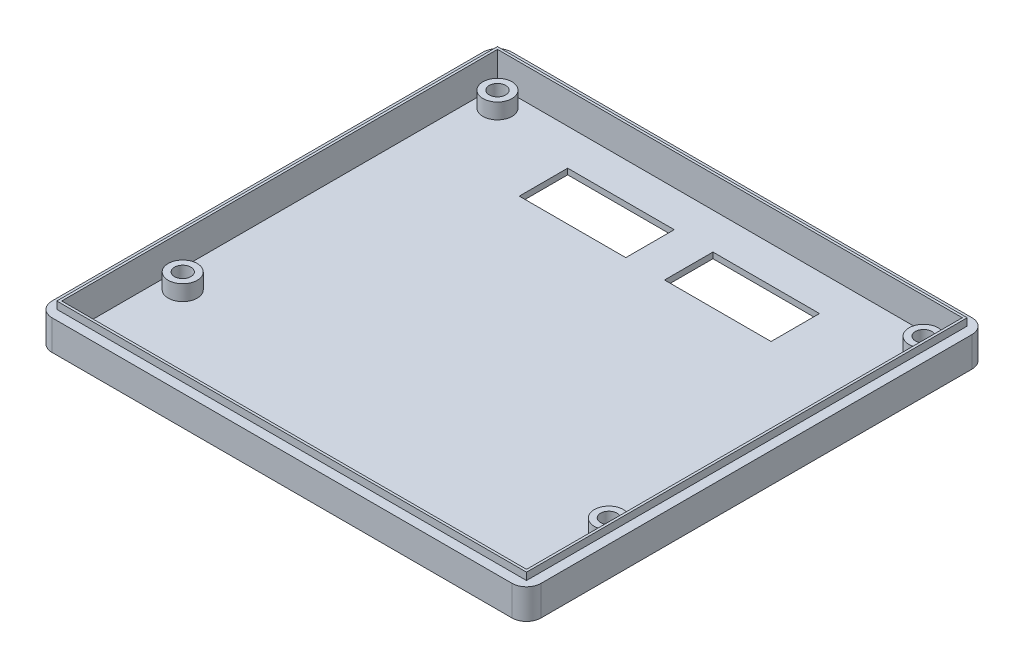
ISO-10303-21;
HEADER;
FILE_DESCRIPTION(('STEP AP214'),'2;1');
FILE_NAME('part.step','',(''),(''),'','','');
FILE_SCHEMA(('AUTOMOTIVE_DESIGN { 1 0 10303 214 1 1 1 1 }'));
ENDSEC;
DATA;
#1=APPLICATION_CONTEXT('core data for automotive mechanical design processes');
#2=APPLICATION_PROTOCOL_DEFINITION('international standard','automotive_design',2000,#1);
#3=PRODUCT_CONTEXT('',#1,'mechanical');
#4=PRODUCT('Part','Part','',(#3));
#5=PRODUCT_RELATED_PRODUCT_CATEGORY('part','',(#4));
#6=PRODUCT_DEFINITION_FORMATION('','',#4);
#7=PRODUCT_DEFINITION_CONTEXT('part definition',#1,'design');
#8=PRODUCT_DEFINITION('design','',#6,#7);
#9=PRODUCT_DEFINITION_SHAPE('','',#8);
#10=(LENGTH_UNIT() NAMED_UNIT(*) SI_UNIT(.MILLI.,.METRE.));
#11=(NAMED_UNIT(*) PLANE_ANGLE_UNIT() SI_UNIT($,.RADIAN.));
#12=(NAMED_UNIT(*) SI_UNIT($,.STERADIAN.) SOLID_ANGLE_UNIT());
#13=UNCERTAINTY_MEASURE_WITH_UNIT(LENGTH_MEASURE(1.E-05),#10,'distance_accuracy_value','');
#14=(GEOMETRIC_REPRESENTATION_CONTEXT(3) GLOBAL_UNCERTAINTY_ASSIGNED_CONTEXT((#13)) GLOBAL_UNIT_ASSIGNED_CONTEXT((#10,
#11,#12)) REPRESENTATION_CONTEXT('',''));
#15=CARTESIAN_POINT('',(0.,0.,0.));
#16=DIRECTION('',(0.,0.,1.));
#17=DIRECTION('',(1.,0.,0.));
#18=AXIS2_PLACEMENT_3D('',#15,#16,#17);
#19=CARTESIAN_POINT('',(0.,6.2,0.));
#20=DIRECTION('',(0.,1.,0.));
#21=DIRECTION('',(0.,0.,1.));
#22=AXIS2_PLACEMENT_3D('',#19,#20,#21);
#23=PLANE('',#22);
#24=DIRECTION('',(1.,0.,0.));
#25=VECTOR('',#24,1.);
#26=CARTESIAN_POINT('',(-4.,6.2,4.));
#27=LINE('',#26,#25);
#28=CARTESIAN_POINT('',(-1.,6.2,4.));
#29=VERTEX_POINT('',#28);
#30=CARTESIAN_POINT('',(94.,6.2,4.));
#31=VERTEX_POINT('',#30);
#32=EDGE_CURVE('E379',#29,#31,#27,.T.);
#33=ORIENTED_EDGE('',*,*,#32,.T.);
#34=CARTESIAN_POINT('',(94.,6.2,1.));
#35=DIRECTION('',(0.,1.,0.));
#36=DIRECTION('',(0.,0.,1.));
#37=AXIS2_PLACEMENT_3D('',#34,#35,#36);
#38=CIRCLE('',#37,3.);
#39=CARTESIAN_POINT('',(97.,6.2,0.999999999999999));
#40=VERTEX_POINT('',#39);
#41=EDGE_CURVE('E422',#31,#40,#38,.T.);
#42=ORIENTED_EDGE('',*,*,#41,.T.);
#43=DIRECTION('',(0.,0.,-1.));
#44=VECTOR('',#43,1.);
#45=CARTESIAN_POINT('',(97.,6.2,4.));
#46=LINE('',#45,#44);
#47=CARTESIAN_POINT('',(97.,6.2,-88.));
#48=VERTEX_POINT('',#47);
#49=EDGE_CURVE('E382',#40,#48,#46,.T.);
#50=ORIENTED_EDGE('',*,*,#49,.T.);
#51=CARTESIAN_POINT('',(94.,6.2,-88.));
#52=DIRECTION('',(0.,1.,0.));
#53=DIRECTION('',(0.,0.,1.));
#54=AXIS2_PLACEMENT_3D('',#51,#52,#53);
#55=CIRCLE('',#54,3.);
#56=CARTESIAN_POINT('',(94.,6.2,-91.));
#57=VERTEX_POINT('',#56);
#58=EDGE_CURVE('E418',#48,#57,#55,.T.);
#59=ORIENTED_EDGE('',*,*,#58,.T.);
#60=DIRECTION('',(-1.,0.,0.));
#61=VECTOR('',#60,1.);
#62=CARTESIAN_POINT('',(97.,6.2,-91.));
#63=LINE('',#62,#61);
#64=CARTESIAN_POINT('',(-1.00000000000003,6.2,-91.));
#65=VERTEX_POINT('',#64);
#66=EDGE_CURVE('E385',#57,#65,#63,.T.);
#67=ORIENTED_EDGE('',*,*,#66,.T.);
#68=CARTESIAN_POINT('',(-1.00000000000003,6.2,-88.));
#69=DIRECTION('',(0.,1.,0.));
#70=DIRECTION('',(0.,0.,1.));
#71=AXIS2_PLACEMENT_3D('',#68,#69,#70);
#72=CIRCLE('',#71,3.);
#73=CARTESIAN_POINT('',(-4.00000000000003,6.2,-88.));
#74=VERTEX_POINT('',#73);
#75=EDGE_CURVE('E416',#65,#74,#72,.T.);
#76=ORIENTED_EDGE('',*,*,#75,.T.);
#77=DIRECTION('',(0.,0.,1.));
#78=VECTOR('',#77,1.);
#79=CARTESIAN_POINT('',(-4.00000000000003,6.2,-91.));
#80=LINE('',#79,#78);
#81=CARTESIAN_POINT('',(-4.,6.2,1.));
#82=VERTEX_POINT('',#81);
#83=EDGE_CURVE('E208',#74,#82,#80,.T.);
#84=ORIENTED_EDGE('',*,*,#83,.T.);
#85=CARTESIAN_POINT('',(-1.,6.2,1.));
#86=DIRECTION('',(0.,1.,0.));
#87=DIRECTION('',(0.,0.,1.));
#88=AXIS2_PLACEMENT_3D('',#85,#86,#87);
#89=CIRCLE('',#88,3.);
#90=EDGE_CURVE('E420',#82,#29,#89,.T.);
#91=ORIENTED_EDGE('',*,*,#90,.T.);
#92=EDGE_LOOP('',(#33,#42,#50,#59,#67,#76,#84,#91));
#93=FACE_BOUND('',#92,.T.);
#94=DIRECTION('',(1.,0.,0.));
#95=VECTOR('',#94,1.);
#96=CARTESIAN_POINT('',(95.,6.2,2.));
#97=LINE('',#96,#95);
#98=CARTESIAN_POINT('',(-2.00000000000003,6.2,2.00000000000001));
#99=VERTEX_POINT('',#98);
#100=CARTESIAN_POINT('',(95.,6.2,2.));
#101=VERTEX_POINT('',#100);
#102=EDGE_CURVE('E242',#99,#101,#97,.T.);
#103=ORIENTED_EDGE('',*,*,#102,.F.);
#104=DIRECTION('',(0.,0.,1.));
#105=VECTOR('',#104,1.);
#106=CARTESIAN_POINT('',(-2.00000000000003,6.2,2.00000000000001));
#107=LINE('',#106,#105);
#108=CARTESIAN_POINT('',(-2.00000000000003,6.2,-89.));
#109=VERTEX_POINT('',#108);
#110=EDGE_CURVE('E228',#109,#99,#107,.T.);
#111=ORIENTED_EDGE('',*,*,#110,.F.);
#112=DIRECTION('',(-1.,0.,0.));
#113=VECTOR('',#112,1.);
#114=CARTESIAN_POINT('',(-2.00000000000003,6.2,-89.));
#115=LINE('',#114,#113);
#116=CARTESIAN_POINT('',(95.,6.2,-89.));
#117=VERTEX_POINT('',#116);
#118=EDGE_CURVE('E233',#117,#109,#115,.T.);
#119=ORIENTED_EDGE('',*,*,#118,.F.);
#120=DIRECTION('',(0.,0.,-1.));
#121=VECTOR('',#120,1.);
#122=CARTESIAN_POINT('',(95.,6.2,-89.));
#123=LINE('',#122,#121);
#124=EDGE_CURVE('E244',#101,#117,#123,.T.);
#125=ORIENTED_EDGE('',*,*,#124,.F.);
#126=EDGE_LOOP('',(#103,#111,#119,#125));
#127=FACE_BOUND('',#126,.T.);
#128=ADVANCED_FACE('F34',(#93,#127),#23,.T.);
#129=CARTESIAN_POINT('',(-4.00000000000003,1.2,-91.));
#130=DIRECTION('',(1.,0.,0.));
#131=DIRECTION('',(0.,0.,-1.));
#132=AXIS2_PLACEMENT_3D('',#129,#130,#131);
#133=PLANE('',#132);
#134=DIRECTION('',(0.,0.,1.));
#135=VECTOR('',#134,1.);
#136=CARTESIAN_POINT('',(-4.00000000000003,0.,-91.));
#137=LINE('',#136,#135);
#138=CARTESIAN_POINT('',(-4.00000000000003,0.,-88.));
#139=VERTEX_POINT('',#138);
#140=CARTESIAN_POINT('',(-4.,0.,1.));
#141=VERTEX_POINT('',#140);
#142=EDGE_CURVE('E387',#139,#141,#137,.T.);
#143=ORIENTED_EDGE('',*,*,#142,.T.);
#144=DIRECTION('',(0.,-1.,0.));
#145=VECTOR('',#144,1.);
#146=CARTESIAN_POINT('',(-4.,1.2,1.));
#147=LINE('',#146,#145);
#148=EDGE_CURVE('E427',#141,#82,#147,.F.);
#149=ORIENTED_EDGE('',*,*,#148,.T.);
#150=ORIENTED_EDGE('',*,*,#83,.F.);
#151=DIRECTION('',(0.,-1.,0.));
#152=VECTOR('',#151,1.);
#153=CARTESIAN_POINT('',(-4.00000000000003,1.2,-88.));
#154=LINE('',#153,#152);
#155=EDGE_CURVE('E424',#74,#139,#154,.T.);
#156=ORIENTED_EDGE('',*,*,#155,.T.);
#157=EDGE_LOOP('',(#143,#149,#150,#156));
#158=FACE_BOUND('',#157,.T.);
#159=ADVANCED_FACE('F431',(#158),#133,.F.);
#160=CARTESIAN_POINT('',(-4.,1.2,4.));
#161=DIRECTION('',(0.,0.,-1.));
#162=DIRECTION('',(-1.,0.,0.));
#163=AXIS2_PLACEMENT_3D('',#160,#161,#162);
#164=PLANE('',#163);
#165=DIRECTION('',(1.,0.,0.));
#166=VECTOR('',#165,1.);
#167=CARTESIAN_POINT('',(-4.,0.,4.));
#168=LINE('',#167,#166);
#169=CARTESIAN_POINT('',(-1.,0.,4.));
#170=VERTEX_POINT('',#169);
#171=CARTESIAN_POINT('',(94.,0.,4.));
#172=VERTEX_POINT('',#171);
#173=EDGE_CURVE('E390',#170,#172,#168,.T.);
#174=ORIENTED_EDGE('',*,*,#173,.T.);
#175=DIRECTION('',(0.,-1.,0.));
#176=VECTOR('',#175,1.);
#177=CARTESIAN_POINT('',(94.,1.2,4.));
#178=LINE('',#177,#176);
#179=EDGE_CURVE('E414',#172,#31,#178,.F.);
#180=ORIENTED_EDGE('',*,*,#179,.T.);
#181=ORIENTED_EDGE('',*,*,#32,.F.);
#182=DIRECTION('',(0.,-1.,0.));
#183=VECTOR('',#182,1.);
#184=CARTESIAN_POINT('',(-1.,1.2,4.));
#185=LINE('',#184,#183);
#186=EDGE_CURVE('E411',#29,#170,#185,.T.);
#187=ORIENTED_EDGE('',*,*,#186,.T.);
#188=EDGE_LOOP('',(#174,#180,#181,#187));
#189=FACE_BOUND('',#188,.T.);
#190=ADVANCED_FACE('F444',(#189),#164,.F.);
#191=CARTESIAN_POINT('',(97.,1.2,4.));
#192=DIRECTION('',(-1.,0.,0.));
#193=DIRECTION('',(0.,0.,1.));
#194=AXIS2_PLACEMENT_3D('',#191,#192,#193);
#195=PLANE('',#194);
#196=ORIENTED_EDGE('',*,*,#49,.F.);
#197=DIRECTION('',(0.,-1.,0.));
#198=VECTOR('',#197,1.);
#199=CARTESIAN_POINT('',(97.,1.2,0.999999999999999));
#200=LINE('',#199,#198);
#201=CARTESIAN_POINT('',(97.,0.,0.999999999999999));
#202=VERTEX_POINT('',#201);
#203=EDGE_CURVE('E400',#40,#202,#200,.T.);
#204=ORIENTED_EDGE('',*,*,#203,.T.);
#205=DIRECTION('',(0.,0.,-1.));
#206=VECTOR('',#205,1.);
#207=CARTESIAN_POINT('',(97.,0.,4.));
#208=LINE('',#207,#206);
#209=CARTESIAN_POINT('',(97.,0.,-88.));
#210=VERTEX_POINT('',#209);
#211=EDGE_CURVE('E393',#202,#210,#208,.T.);
#212=ORIENTED_EDGE('',*,*,#211,.T.);
#213=DIRECTION('',(0.,-1.,0.));
#214=VECTOR('',#213,1.);
#215=CARTESIAN_POINT('',(97.,1.2,-88.));
#216=LINE('',#215,#214);
#217=EDGE_CURVE('E398',#210,#48,#216,.F.);
#218=ORIENTED_EDGE('',*,*,#217,.T.);
#219=EDGE_LOOP('',(#196,#204,#212,#218));
#220=FACE_BOUND('',#219,.T.);
#221=ADVANCED_FACE('F455',(#220),#195,.F.);
#222=CARTESIAN_POINT('',(97.,1.2,-91.));
#223=DIRECTION('',(0.,0.,1.));
#224=DIRECTION('',(1.,0.,0.));
#225=AXIS2_PLACEMENT_3D('',#222,#223,#224);
#226=PLANE('',#225);
#227=ORIENTED_EDGE('',*,*,#66,.F.);
#228=DIRECTION('',(0.,-1.,0.));
#229=VECTOR('',#228,1.);
#230=CARTESIAN_POINT('',(94.,1.2,-91.));
#231=LINE('',#230,#229);
#232=CARTESIAN_POINT('',(94.,0.,-91.));
#233=VERTEX_POINT('',#232);
#234=EDGE_CURVE('E11',#57,#233,#231,.T.);
#235=ORIENTED_EDGE('',*,*,#234,.T.);
#236=DIRECTION('',(-1.,0.,0.));
#237=VECTOR('',#236,1.);
#238=CARTESIAN_POINT('',(97.,0.,-91.));
#239=LINE('',#238,#237);
#240=CARTESIAN_POINT('',(-1.00000000000003,0.,-91.));
#241=VERTEX_POINT('',#240);
#242=EDGE_CURVE('E396',#233,#241,#239,.T.);
#243=ORIENTED_EDGE('',*,*,#242,.T.);
#244=DIRECTION('',(0.,-1.,0.));
#245=VECTOR('',#244,1.);
#246=CARTESIAN_POINT('',(-1.00000000000003,1.2,-91.));
#247=LINE('',#246,#245);
#248=EDGE_CURVE('E42',#241,#65,#247,.F.);
#249=ORIENTED_EDGE('',*,*,#248,.T.);
#250=EDGE_LOOP('',(#227,#235,#243,#249));
#251=FACE_BOUND('',#250,.T.);
#252=ADVANCED_FACE('F462',(#251),#226,.F.);
#253=CARTESIAN_POINT('',(0.,0.,0.));
#254=DIRECTION('',(0.,1.,0.));
#255=DIRECTION('',(0.,0.,1.));
#256=AXIS2_PLACEMENT_3D('',#253,#254,#255);
#257=PLANE('',#256);
#258=DIRECTION('',(1.,0.,0.));
#259=VECTOR('',#258,1.);
#260=CARTESIAN_POINT('',(20.5,0.,-81.));
#261=LINE('',#260,#259);
#262=CARTESIAN_POINT('',(20.5,0.,-81.));
#263=VERTEX_POINT('',#262);
#264=CARTESIAN_POINT('',(42.5,0.,-81.));
#265=VERTEX_POINT('',#264);
#266=EDGE_CURVE('E257',#263,#265,#261,.T.);
#267=ORIENTED_EDGE('',*,*,#266,.F.);
#268=DIRECTION('',(0.,0.,-1.));
#269=VECTOR('',#268,1.);
#270=CARTESIAN_POINT('',(20.5,0.,-71.));
#271=LINE('',#270,#269);
#272=CARTESIAN_POINT('',(20.5,0.,-71.));
#273=VERTEX_POINT('',#272);
#274=EDGE_CURVE('E260',#273,#263,#271,.T.);
#275=ORIENTED_EDGE('',*,*,#274,.F.);
#276=DIRECTION('',(-1.,0.,0.));
#277=VECTOR('',#276,1.);
#278=CARTESIAN_POINT('',(20.5,0.,-71.));
#279=LINE('',#278,#277);
#280=CARTESIAN_POINT('',(42.5,0.,-71.));
#281=VERTEX_POINT('',#280);
#282=EDGE_CURVE('E277',#281,#273,#279,.T.);
#283=ORIENTED_EDGE('',*,*,#282,.F.);
#284=DIRECTION('',(0.,0.,1.));
#285=VECTOR('',#284,1.);
#286=CARTESIAN_POINT('',(42.5,0.,-71.));
#287=LINE('',#286,#285);
#288=EDGE_CURVE('E255',#265,#281,#287,.T.);
#289=ORIENTED_EDGE('',*,*,#288,.F.);
#290=EDGE_LOOP('',(#267,#275,#283,#289));
#291=FACE_BOUND('',#290,.T.);
#292=DIRECTION('',(1.,0.,0.));
#293=VECTOR('',#292,1.);
#294=CARTESIAN_POINT('',(50.5,0.,-81.));
#295=LINE('',#294,#293);
#296=CARTESIAN_POINT('',(50.5,0.,-81.));
#297=VERTEX_POINT('',#296);
#298=CARTESIAN_POINT('',(72.5,0.,-81.));
#299=VERTEX_POINT('',#298);
#300=EDGE_CURVE('E288',#297,#299,#295,.T.);
#301=ORIENTED_EDGE('',*,*,#300,.F.);
#302=DIRECTION('',(0.,0.,-1.));
#303=VECTOR('',#302,1.);
#304=CARTESIAN_POINT('',(50.5,0.,-71.));
#305=LINE('',#304,#303);
#306=CARTESIAN_POINT('',(50.5,0.,-71.));
#307=VERTEX_POINT('',#306);
#308=EDGE_CURVE('E291',#307,#297,#305,.T.);
#309=ORIENTED_EDGE('',*,*,#308,.F.);
#310=DIRECTION('',(-1.,0.,0.));
#311=VECTOR('',#310,1.);
#312=CARTESIAN_POINT('',(50.5,0.,-71.));
#313=LINE('',#312,#311);
#314=CARTESIAN_POINT('',(72.5,0.,-71.));
#315=VERTEX_POINT('',#314);
#316=EDGE_CURVE('E308',#315,#307,#313,.T.);
#317=ORIENTED_EDGE('',*,*,#316,.F.);
#318=DIRECTION('',(0.,0.,1.));
#319=VECTOR('',#318,1.);
#320=CARTESIAN_POINT('',(72.5,0.,-71.));
#321=LINE('',#320,#319);
#322=EDGE_CURVE('E286',#299,#315,#321,.T.);
#323=ORIENTED_EDGE('',*,*,#322,.F.);
#324=EDGE_LOOP('',(#301,#309,#317,#323));
#325=FACE_BOUND('',#324,.T.);
#326=CARTESIAN_POINT('',(2.49999999999997,0.,-19.5));
#327=DIRECTION('',(0.,1.,0.));
#328=DIRECTION('',(0.,0.,1.));
#329=AXIS2_PLACEMENT_3D('',#326,#327,#328);
#330=CIRCLE('',#329,1.7);
#331=CARTESIAN_POINT('',(2.49999999999997,0.,-17.8));
#332=VERTEX_POINT('',#331);
#333=EDGE_CURVE('E320',#332,#332,#330,.F.);
#334=ORIENTED_EDGE('',*,*,#333,.F.);
#335=EDGE_LOOP('',(#334));
#336=FACE_BOUND('',#335,.T.);
#337=CARTESIAN_POINT('',(90.5,0.,-19.5));
#338=DIRECTION('',(0.,1.,0.));
#339=DIRECTION('',(0.,0.,1.));
#340=AXIS2_PLACEMENT_3D('',#337,#338,#339);
#341=CIRCLE('',#340,1.7);
#342=CARTESIAN_POINT('',(90.5,0.,-17.8));
#343=VERTEX_POINT('',#342);
#344=EDGE_CURVE('E326',#343,#343,#341,.F.);
#345=ORIENTED_EDGE('',*,*,#344,.F.);
#346=EDGE_LOOP('',(#345));
#347=FACE_BOUND('',#346,.T.);
#348=CARTESIAN_POINT('',(90.5,0.,-84.5));
#349=DIRECTION('',(0.,1.,0.));
#350=DIRECTION('',(0.,0.,1.));
#351=AXIS2_PLACEMENT_3D('',#348,#349,#350);
#352=CIRCLE('',#351,1.7);
#353=CARTESIAN_POINT('',(90.5,0.,-82.8));
#354=VERTEX_POINT('',#353);
#355=EDGE_CURVE('E332',#354,#354,#352,.F.);
#356=ORIENTED_EDGE('',*,*,#355,.F.);
#357=EDGE_LOOP('',(#356));
#358=FACE_BOUND('',#357,.T.);
#359=CARTESIAN_POINT('',(2.49999999999997,0.,-84.5));
#360=DIRECTION('',(0.,1.,0.));
#361=DIRECTION('',(0.,0.,1.));
#362=AXIS2_PLACEMENT_3D('',#359,#360,#361);
#363=CIRCLE('',#362,1.7);
#364=CARTESIAN_POINT('',(2.49999999999997,0.,-82.8));
#365=VERTEX_POINT('',#364);
#366=EDGE_CURVE('E338',#365,#365,#363,.F.);
#367=ORIENTED_EDGE('',*,*,#366,.F.);
#368=EDGE_LOOP('',(#367));
#369=FACE_BOUND('',#368,.T.);
#370=ORIENTED_EDGE('',*,*,#211,.F.);
#371=CARTESIAN_POINT('',(94.,0.,1.));
#372=DIRECTION('',(0.,1.,0.));
#373=DIRECTION('',(0.,0.,1.));
#374=AXIS2_PLACEMENT_3D('',#371,#372,#373);
#375=CIRCLE('',#374,3.);
#376=EDGE_CURVE('E409',#202,#172,#375,.F.);
#377=ORIENTED_EDGE('',*,*,#376,.T.);
#378=ORIENTED_EDGE('',*,*,#173,.F.);
#379=CARTESIAN_POINT('',(-1.,0.,1.));
#380=DIRECTION('',(0.,1.,0.));
#381=DIRECTION('',(0.,0.,1.));
#382=AXIS2_PLACEMENT_3D('',#379,#380,#381);
#383=CIRCLE('',#382,3.);
#384=EDGE_CURVE('E407',#170,#141,#383,.F.);
#385=ORIENTED_EDGE('',*,*,#384,.T.);
#386=ORIENTED_EDGE('',*,*,#142,.F.);
#387=CARTESIAN_POINT('',(-1.00000000000003,0.,-88.));
#388=DIRECTION('',(0.,1.,0.));
#389=DIRECTION('',(0.,0.,1.));
#390=AXIS2_PLACEMENT_3D('',#387,#388,#389);
#391=CIRCLE('',#390,3.);
#392=EDGE_CURVE('E403',#139,#241,#391,.F.);
#393=ORIENTED_EDGE('',*,*,#392,.T.);
#394=ORIENTED_EDGE('',*,*,#242,.F.);
#395=CARTESIAN_POINT('',(94.,0.,-88.));
#396=DIRECTION('',(0.,1.,0.));
#397=DIRECTION('',(0.,0.,1.));
#398=AXIS2_PLACEMENT_3D('',#395,#396,#397);
#399=CIRCLE('',#398,3.);
#400=EDGE_CURVE('E405',#233,#210,#399,.F.);
#401=ORIENTED_EDGE('',*,*,#400,.T.);
#402=EDGE_LOOP('',(#370,#377,#378,#385,#386,#393,#394,#401));
#403=FACE_BOUND('',#402,.T.);
#404=ADVANCED_FACE('F448',(#291,#325,#336,#347,#358,#369,#403),#257,.F.);
#405=CARTESIAN_POINT('',(-1.50000000000003,6.2,-88.5));
#406=DIRECTION('',(1.,0.,0.));
#407=DIRECTION('',(0.,0.,-1.));
#408=AXIS2_PLACEMENT_3D('',#405,#406,#407);
#409=PLANE('',#408);
#410=DIRECTION('',(0.,0.,1.));
#411=VECTOR('',#410,1.);
#412=CARTESIAN_POINT('',(-1.50000000000003,1.2,-88.5));
#413=LINE('',#412,#411);
#414=CARTESIAN_POINT('',(-1.50000000000003,1.2,-88.5));
#415=VERTEX_POINT('',#414);
#416=CARTESIAN_POINT('',(-1.5,1.2,1.5));
#417=VERTEX_POINT('',#416);
#418=EDGE_CURVE('E363',#415,#417,#413,.T.);
#419=ORIENTED_EDGE('',*,*,#418,.F.);
#420=DIRECTION('',(0.,-1.,0.));
#421=VECTOR('',#420,1.);
#422=CARTESIAN_POINT('',(-1.50000000000003,6.2,-88.5));
#423=LINE('',#422,#421);
#424=CARTESIAN_POINT('',(-1.50000000000003,7.7,-88.5));
#425=VERTEX_POINT('',#424);
#426=EDGE_CURVE('E215',#425,#415,#423,.T.);
#427=ORIENTED_EDGE('',*,*,#426,.F.);
#428=DIRECTION('',(0.,0.,1.));
#429=VECTOR('',#428,1.);
#430=CARTESIAN_POINT('',(-1.5,7.7,1.5));
#431=LINE('',#430,#429);
#432=CARTESIAN_POINT('',(-1.5,7.7,1.5));
#433=VERTEX_POINT('',#432);
#434=EDGE_CURVE('E212',#425,#433,#431,.T.);
#435=ORIENTED_EDGE('',*,*,#434,.T.);
#436=DIRECTION('',(0.,-1.,0.));
#437=VECTOR('',#436,1.);
#438=CARTESIAN_POINT('',(-1.5,6.2,1.5));
#439=LINE('',#438,#437);
#440=EDGE_CURVE('E198',#433,#417,#439,.T.);
#441=ORIENTED_EDGE('',*,*,#440,.T.);
#442=EDGE_LOOP('',(#419,#427,#435,#441));
#443=FACE_BOUND('',#442,.T.);
#444=ADVANCED_FACE('F213',(#443),#409,.T.);
#445=CARTESIAN_POINT('',(-1.5,6.2,1.5));
#446=DIRECTION('',(0.,0.,-1.));
#447=DIRECTION('',(-1.,0.,0.));
#448=AXIS2_PLACEMENT_3D('',#445,#446,#447);
#449=PLANE('',#448);
#450=DIRECTION('',(1.,0.,0.));
#451=VECTOR('',#450,1.);
#452=CARTESIAN_POINT('',(-1.5,1.2,1.5));
#453=LINE('',#452,#451);
#454=CARTESIAN_POINT('',(94.5,1.2,1.5));
#455=VERTEX_POINT('',#454);
#456=EDGE_CURVE('E205',#417,#455,#453,.T.);
#457=ORIENTED_EDGE('',*,*,#456,.F.);
#458=ORIENTED_EDGE('',*,*,#440,.F.);
#459=DIRECTION('',(1.,0.,0.));
#460=VECTOR('',#459,1.);
#461=CARTESIAN_POINT('',(94.5,7.7,1.5));
#462=LINE('',#461,#460);
#463=CARTESIAN_POINT('',(94.5,7.7,1.5));
#464=VERTEX_POINT('',#463);
#465=EDGE_CURVE('E203',#433,#464,#462,.T.);
#466=ORIENTED_EDGE('',*,*,#465,.T.);
#467=DIRECTION('',(0.,-1.,0.));
#468=VECTOR('',#467,1.);
#469=CARTESIAN_POINT('',(94.5,6.2,1.5));
#470=LINE('',#469,#468);
#471=EDGE_CURVE('E209',#464,#455,#470,.T.);
#472=ORIENTED_EDGE('',*,*,#471,.T.);
#473=EDGE_LOOP('',(#457,#458,#466,#472));
#474=FACE_BOUND('',#473,.T.);
#475=ADVANCED_FACE('F200',(#474),#449,.T.);
#476=CARTESIAN_POINT('',(94.5,6.2,1.5));
#477=DIRECTION('',(-1.,0.,0.));
#478=DIRECTION('',(0.,0.,1.));
#479=AXIS2_PLACEMENT_3D('',#476,#477,#478);
#480=PLANE('',#479);
#481=DIRECTION('',(0.,0.,-1.));
#482=VECTOR('',#481,1.);
#483=CARTESIAN_POINT('',(94.5,1.2,1.5));
#484=LINE('',#483,#482);
#485=CARTESIAN_POINT('',(94.5,1.2,-88.5));
#486=VERTEX_POINT('',#485);
#487=EDGE_CURVE('E368',#455,#486,#484,.T.);
#488=ORIENTED_EDGE('',*,*,#487,.F.);
#489=ORIENTED_EDGE('',*,*,#471,.F.);
#490=DIRECTION('',(0.,0.,-1.));
#491=VECTOR('',#490,1.);
#492=CARTESIAN_POINT('',(94.5,7.7,-88.5));
#493=LINE('',#492,#491);
#494=CARTESIAN_POINT('',(94.5,7.7,-88.5));
#495=VERTEX_POINT('',#494);
#496=EDGE_CURVE('E222',#464,#495,#493,.T.);
#497=ORIENTED_EDGE('',*,*,#496,.T.);
#498=DIRECTION('',(0.,-1.,0.));
#499=VECTOR('',#498,1.);
#500=CARTESIAN_POINT('',(94.5,6.2,-88.5));
#501=LINE('',#500,#499);
#502=EDGE_CURVE('E373',#495,#486,#501,.T.);
#503=ORIENTED_EDGE('',*,*,#502,.T.);
#504=EDGE_LOOP('',(#488,#489,#497,#503));
#505=FACE_BOUND('',#504,.T.);
#506=ADVANCED_FACE('F534',(#505),#480,.T.);
#507=CARTESIAN_POINT('',(94.5,6.2,-88.5));
#508=DIRECTION('',(0.,0.,1.));
#509=DIRECTION('',(1.,0.,0.));
#510=AXIS2_PLACEMENT_3D('',#507,#508,#509);
#511=PLANE('',#510);
#512=DIRECTION('',(-1.,0.,0.));
#513=VECTOR('',#512,1.);
#514=CARTESIAN_POINT('',(94.5,1.2,-88.5));
#515=LINE('',#514,#513);
#516=EDGE_CURVE('E370',#486,#415,#515,.T.);
#517=ORIENTED_EDGE('',*,*,#516,.F.);
#518=ORIENTED_EDGE('',*,*,#502,.F.);
#519=DIRECTION('',(-1.,0.,0.));
#520=VECTOR('',#519,1.);
#521=CARTESIAN_POINT('',(-1.50000000000003,7.7,-88.5));
#522=LINE('',#521,#520);
#523=EDGE_CURVE('E224',#495,#425,#522,.T.);
#524=ORIENTED_EDGE('',*,*,#523,.T.);
#525=ORIENTED_EDGE('',*,*,#426,.T.);
#526=EDGE_LOOP('',(#517,#518,#524,#525));
#527=FACE_BOUND('',#526,.T.);
#528=ADVANCED_FACE('F485',(#527),#511,.T.);
#529=CARTESIAN_POINT('',(0.,1.2,0.));
#530=DIRECTION('',(0.,1.,0.));
#531=DIRECTION('',(0.,0.,1.));
#532=AXIS2_PLACEMENT_3D('',#529,#530,#531);
#533=PLANE('',#532);
#534=DIRECTION('',(0.,0.,1.));
#535=VECTOR('',#534,1.);
#536=CARTESIAN_POINT('',(20.5,1.2,-71.));
#537=LINE('',#536,#535);
#538=CARTESIAN_POINT('',(20.5,1.2,-81.));
#539=VERTEX_POINT('',#538);
#540=CARTESIAN_POINT('',(20.5,1.2,-71.));
#541=VERTEX_POINT('',#540);
#542=EDGE_CURVE('E263',#539,#541,#537,.T.);
#543=ORIENTED_EDGE('',*,*,#542,.F.);
#544=DIRECTION('',(-1.,0.,0.));
#545=VECTOR('',#544,1.);
#546=CARTESIAN_POINT('',(20.5,1.2,-81.));
#547=LINE('',#546,#545);
#548=CARTESIAN_POINT('',(42.5,1.2,-81.));
#549=VERTEX_POINT('',#548);
#550=EDGE_CURVE('E271',#549,#539,#547,.T.);
#551=ORIENTED_EDGE('',*,*,#550,.F.);
#552=DIRECTION('',(0.,0.,-1.));
#553=VECTOR('',#552,1.);
#554=CARTESIAN_POINT('',(42.5,1.2,-71.));
#555=LINE('',#554,#553);
#556=CARTESIAN_POINT('',(42.5,1.2,-71.));
#557=VERTEX_POINT('',#556);
#558=EDGE_CURVE('E268',#557,#549,#555,.T.);
#559=ORIENTED_EDGE('',*,*,#558,.F.);
#560=DIRECTION('',(1.,0.,0.));
#561=VECTOR('',#560,1.);
#562=CARTESIAN_POINT('',(20.5,1.2,-71.));
#563=LINE('',#562,#561);
#564=EDGE_CURVE('E265',#541,#557,#563,.T.);
#565=ORIENTED_EDGE('',*,*,#564,.F.);
#566=EDGE_LOOP('',(#543,#551,#559,#565));
#567=FACE_BOUND('',#566,.T.);
#568=DIRECTION('',(0.,0.,1.));
#569=VECTOR('',#568,1.);
#570=CARTESIAN_POINT('',(50.5,1.2,-71.));
#571=LINE('',#570,#569);
#572=CARTESIAN_POINT('',(50.5,1.2,-81.));
#573=VERTEX_POINT('',#572);
#574=CARTESIAN_POINT('',(50.5,1.2,-71.));
#575=VERTEX_POINT('',#574);
#576=EDGE_CURVE('E294',#573,#575,#571,.T.);
#577=ORIENTED_EDGE('',*,*,#576,.F.);
#578=DIRECTION('',(-1.,0.,0.));
#579=VECTOR('',#578,1.);
#580=CARTESIAN_POINT('',(50.5,1.2,-81.));
#581=LINE('',#580,#579);
#582=CARTESIAN_POINT('',(72.5,1.2,-81.));
#583=VERTEX_POINT('',#582);
#584=EDGE_CURVE('E302',#583,#573,#581,.T.);
#585=ORIENTED_EDGE('',*,*,#584,.F.);
#586=DIRECTION('',(0.,0.,-1.));
#587=VECTOR('',#586,1.);
#588=CARTESIAN_POINT('',(72.5,1.2,-71.));
#589=LINE('',#588,#587);
#590=CARTESIAN_POINT('',(72.5,1.2,-71.));
#591=VERTEX_POINT('',#590);
#592=EDGE_CURVE('E299',#591,#583,#589,.T.);
#593=ORIENTED_EDGE('',*,*,#592,.F.);
#594=DIRECTION('',(1.,0.,0.));
#595=VECTOR('',#594,1.);
#596=CARTESIAN_POINT('',(50.5,1.2,-71.));
#597=LINE('',#596,#595);
#598=EDGE_CURVE('E296',#575,#591,#597,.T.);
#599=ORIENTED_EDGE('',*,*,#598,.F.);
#600=EDGE_LOOP('',(#577,#585,#593,#599));
#601=FACE_BOUND('',#600,.T.);
#602=CARTESIAN_POINT('',(2.49999999999997,1.2,-19.5));
#603=DIRECTION('',(0.,1.,0.));
#604=DIRECTION('',(0.,0.,1.));
#605=AXIS2_PLACEMENT_3D('',#602,#603,#604);
#606=CIRCLE('',#605,3.);
#607=CARTESIAN_POINT('',(2.49999999999997,1.2,-16.5));
#608=VERTEX_POINT('',#607);
#609=EDGE_CURVE('E341',#608,#608,#606,.T.);
#610=ORIENTED_EDGE('',*,*,#609,.F.);
#611=EDGE_LOOP('',(#610));
#612=FACE_BOUND('',#611,.T.);
#613=CARTESIAN_POINT('',(90.5,1.2,-19.5));
#614=DIRECTION('',(0.,1.,0.));
#615=DIRECTION('',(0.,0.,1.));
#616=AXIS2_PLACEMENT_3D('',#613,#614,#615);
#617=CIRCLE('',#616,3.00000000000001);
#618=CARTESIAN_POINT('',(90.5,1.2,-16.5));
#619=VERTEX_POINT('',#618);
#620=EDGE_CURVE('E345',#619,#619,#617,.T.);
#621=ORIENTED_EDGE('',*,*,#620,.F.);
#622=EDGE_LOOP('',(#621));
#623=FACE_BOUND('',#622,.T.);
#624=CARTESIAN_POINT('',(90.5,1.2,-84.5));
#625=DIRECTION('',(0.,1.,0.));
#626=DIRECTION('',(0.,0.,1.));
#627=AXIS2_PLACEMENT_3D('',#624,#625,#626);
#628=CIRCLE('',#627,3.00000000000001);
#629=CARTESIAN_POINT('',(90.5,1.2,-81.5));
#630=VERTEX_POINT('',#629);
#631=EDGE_CURVE('E351',#630,#630,#628,.T.);
#632=ORIENTED_EDGE('',*,*,#631,.F.);
#633=EDGE_LOOP('',(#632));
#634=FACE_BOUND('',#633,.T.);
#635=CARTESIAN_POINT('',(2.49999999999997,1.2,-84.5));
#636=DIRECTION('',(0.,1.,0.));
#637=DIRECTION('',(0.,0.,1.));
#638=AXIS2_PLACEMENT_3D('',#635,#636,#637);
#639=CIRCLE('',#638,3.);
#640=CARTESIAN_POINT('',(2.49999999999997,1.2,-81.5));
#641=VERTEX_POINT('',#640);
#642=EDGE_CURVE('E357',#641,#641,#639,.T.);
#643=ORIENTED_EDGE('',*,*,#642,.F.);
#644=EDGE_LOOP('',(#643));
#645=FACE_BOUND('',#644,.T.);
#646=ORIENTED_EDGE('',*,*,#418,.T.);
#647=ORIENTED_EDGE('',*,*,#456,.T.);
#648=ORIENTED_EDGE('',*,*,#487,.T.);
#649=ORIENTED_EDGE('',*,*,#516,.T.);
#650=EDGE_LOOP('',(#646,#647,#648,#649));
#651=FACE_BOUND('',#650,.T.);
#652=ADVANCED_FACE('F481',(#567,#601,#612,#623,#634,#645,#651),#533,.T.);
#653=CARTESIAN_POINT('',(2.49999999999997,4.4,-84.5));
#654=DIRECTION('',(0.,-1.,0.));
#655=DIRECTION('',(0.,0.,-1.));
#656=AXIS2_PLACEMENT_3D('',#653,#654,#655);
#657=CYLINDRICAL_SURFACE('',#656,3.);
#658=CARTESIAN_POINT('',(2.49999999999997,4.4,-84.5));
#659=DIRECTION('',(0.,1.,0.));
#660=DIRECTION('',(0.,0.,1.));
#661=AXIS2_PLACEMENT_3D('',#658,#659,#660);
#662=CIRCLE('',#661,3.);
#663=CARTESIAN_POINT('',(2.49999999999997,4.4,-81.5));
#664=VERTEX_POINT('',#663);
#665=EDGE_CURVE('E360',#664,#664,#662,.T.);
#666=ORIENTED_EDGE('',*,*,#665,.F.);
#667=EDGE_LOOP('',(#666));
#668=FACE_BOUND('',#667,.T.);
#669=ORIENTED_EDGE('',*,*,#642,.T.);
#670=EDGE_LOOP('',(#669));
#671=FACE_BOUND('',#670,.T.);
#672=ADVANCED_FACE('F484',(#668,#671),#657,.T.);
#673=CARTESIAN_POINT('',(2.49999999999997,4.4,-84.5));
#674=DIRECTION('',(0.,1.,0.));
#675=DIRECTION('',(0.,0.,1.));
#676=AXIS2_PLACEMENT_3D('',#673,#674,#675);
#677=PLANE('',#676);
#678=CARTESIAN_POINT('',(2.49999999999997,4.4,-84.5));
#679=DIRECTION('',(0.,1.,0.));
#680=DIRECTION('',(0.,0.,1.));
#681=AXIS2_PLACEMENT_3D('',#678,#679,#680);
#682=CIRCLE('',#681,1.7);
#683=CARTESIAN_POINT('',(2.49999999999997,4.4,-82.8));
#684=VERTEX_POINT('',#683);
#685=EDGE_CURVE('E335',#684,#684,#682,.T.);
#686=ORIENTED_EDGE('',*,*,#685,.F.);
#687=EDGE_LOOP('',(#686));
#688=FACE_BOUND('',#687,.T.);
#689=ORIENTED_EDGE('',*,*,#665,.T.);
#690=EDGE_LOOP('',(#689));
#691=FACE_BOUND('',#690,.T.);
#692=ADVANCED_FACE('F672',(#688,#691),#677,.T.);
#693=CARTESIAN_POINT('',(90.5,4.4,-84.5));
#694=DIRECTION('',(0.,-1.,0.));
#695=DIRECTION('',(0.,0.,-1.));
#696=AXIS2_PLACEMENT_3D('',#693,#694,#695);
#697=CYLINDRICAL_SURFACE('',#696,3.00000000000001);
#698=CARTESIAN_POINT('',(90.5,4.4,-84.5));
#699=DIRECTION('',(0.,1.,0.));
#700=DIRECTION('',(0.,0.,1.));
#701=AXIS2_PLACEMENT_3D('',#698,#699,#700);
#702=CIRCLE('',#701,3.00000000000001);
#703=CARTESIAN_POINT('',(90.5,4.4,-81.5));
#704=VERTEX_POINT('',#703);
#705=EDGE_CURVE('E354',#704,#704,#702,.T.);
#706=ORIENTED_EDGE('',*,*,#705,.F.);
#707=EDGE_LOOP('',(#706));
#708=FACE_BOUND('',#707,.T.);
#709=ORIENTED_EDGE('',*,*,#631,.T.);
#710=EDGE_LOOP('',(#709));
#711=FACE_BOUND('',#710,.T.);
#712=ADVANCED_FACE('F668',(#708,#711),#697,.T.);
#713=CARTESIAN_POINT('',(90.5,4.4,-84.5));
#714=DIRECTION('',(0.,1.,0.));
#715=DIRECTION('',(0.,0.,1.));
#716=AXIS2_PLACEMENT_3D('',#713,#714,#715);
#717=PLANE('',#716);
#718=CARTESIAN_POINT('',(90.5,4.4,-84.5));
#719=DIRECTION('',(0.,1.,0.));
#720=DIRECTION('',(0.,0.,1.));
#721=AXIS2_PLACEMENT_3D('',#718,#719,#720);
#722=CIRCLE('',#721,1.7);
#723=CARTESIAN_POINT('',(90.5,4.4,-82.8));
#724=VERTEX_POINT('',#723);
#725=EDGE_CURVE('E329',#724,#724,#722,.T.);
#726=ORIENTED_EDGE('',*,*,#725,.F.);
#727=EDGE_LOOP('',(#726));
#728=FACE_BOUND('',#727,.T.);
#729=ORIENTED_EDGE('',*,*,#705,.T.);
#730=EDGE_LOOP('',(#729));
#731=FACE_BOUND('',#730,.T.);
#732=ADVANCED_FACE('F664',(#728,#731),#717,.T.);
#733=CARTESIAN_POINT('',(90.5,4.4,-19.5));
#734=DIRECTION('',(0.,-1.,0.));
#735=DIRECTION('',(0.,0.,-1.));
#736=AXIS2_PLACEMENT_3D('',#733,#734,#735);
#737=CYLINDRICAL_SURFACE('',#736,3.00000000000001);
#738=CARTESIAN_POINT('',(90.5,4.4,-19.5));
#739=DIRECTION('',(0.,1.,0.));
#740=DIRECTION('',(0.,0.,1.));
#741=AXIS2_PLACEMENT_3D('',#738,#739,#740);
#742=CIRCLE('',#741,3.00000000000001);
#743=CARTESIAN_POINT('',(90.5,4.4,-16.5));
#744=VERTEX_POINT('',#743);
#745=EDGE_CURVE('E348',#744,#744,#742,.T.);
#746=ORIENTED_EDGE('',*,*,#745,.F.);
#747=EDGE_LOOP('',(#746));
#748=FACE_BOUND('',#747,.T.);
#749=ORIENTED_EDGE('',*,*,#620,.T.);
#750=EDGE_LOOP('',(#749));
#751=FACE_BOUND('',#750,.T.);
#752=ADVANCED_FACE('F660',(#748,#751),#737,.T.);
#753=CARTESIAN_POINT('',(90.5,4.4,-19.5));
#754=DIRECTION('',(0.,1.,0.));
#755=DIRECTION('',(0.,0.,1.));
#756=AXIS2_PLACEMENT_3D('',#753,#754,#755);
#757=PLANE('',#756);
#758=CARTESIAN_POINT('',(90.5,4.4,-19.5));
#759=DIRECTION('',(0.,1.,0.));
#760=DIRECTION('',(0.,0.,1.));
#761=AXIS2_PLACEMENT_3D('',#758,#759,#760);
#762=CIRCLE('',#761,1.7);
#763=CARTESIAN_POINT('',(90.5,4.4,-17.8));
#764=VERTEX_POINT('',#763);
#765=EDGE_CURVE('E323',#764,#764,#762,.T.);
#766=ORIENTED_EDGE('',*,*,#765,.F.);
#767=EDGE_LOOP('',(#766));
#768=FACE_BOUND('',#767,.T.);
#769=ORIENTED_EDGE('',*,*,#745,.T.);
#770=EDGE_LOOP('',(#769));
#771=FACE_BOUND('',#770,.T.);
#772=ADVANCED_FACE('F656',(#768,#771),#757,.T.);
#773=CARTESIAN_POINT('',(2.49999999999997,4.4,-19.5));
#774=DIRECTION('',(0.,-1.,0.));
#775=DIRECTION('',(0.,0.,-1.));
#776=AXIS2_PLACEMENT_3D('',#773,#774,#775);
#777=CYLINDRICAL_SURFACE('',#776,3.);
#778=CARTESIAN_POINT('',(2.49999999999997,4.4,-19.5));
#779=DIRECTION('',(0.,1.,0.));
#780=DIRECTION('',(0.,0.,1.));
#781=AXIS2_PLACEMENT_3D('',#778,#779,#780);
#782=CIRCLE('',#781,3.);
#783=CARTESIAN_POINT('',(2.49999999999997,4.4,-16.5));
#784=VERTEX_POINT('',#783);
#785=EDGE_CURVE('E342',#784,#784,#782,.T.);
#786=ORIENTED_EDGE('',*,*,#785,.F.);
#787=EDGE_LOOP('',(#786));
#788=FACE_BOUND('',#787,.T.);
#789=ORIENTED_EDGE('',*,*,#609,.T.);
#790=EDGE_LOOP('',(#789));
#791=FACE_BOUND('',#790,.T.);
#792=ADVANCED_FACE('F652',(#788,#791),#777,.T.);
#793=CARTESIAN_POINT('',(2.49999999999997,4.4,-19.5));
#794=DIRECTION('',(0.,1.,0.));
#795=DIRECTION('',(0.,0.,1.));
#796=AXIS2_PLACEMENT_3D('',#793,#794,#795);
#797=PLANE('',#796);
#798=CARTESIAN_POINT('',(2.49999999999997,4.4,-19.5));
#799=DIRECTION('',(0.,1.,0.));
#800=DIRECTION('',(0.,0.,1.));
#801=AXIS2_PLACEMENT_3D('',#798,#799,#800);
#802=CIRCLE('',#801,1.7);
#803=CARTESIAN_POINT('',(2.49999999999997,4.4,-17.8));
#804=VERTEX_POINT('',#803);
#805=EDGE_CURVE('E317',#804,#804,#802,.T.);
#806=ORIENTED_EDGE('',*,*,#805,.F.);
#807=EDGE_LOOP('',(#806));
#808=FACE_BOUND('',#807,.T.);
#809=ORIENTED_EDGE('',*,*,#785,.T.);
#810=EDGE_LOOP('',(#809));
#811=FACE_BOUND('',#810,.T.);
#812=ADVANCED_FACE('F648',(#808,#811),#797,.T.);
#813=CARTESIAN_POINT('',(2.49999999999997,-0.00100000000000013,-84.5));
#814=DIRECTION('',(0.,1.,0.));
#815=DIRECTION('',(0.,0.,1.));
#816=AXIS2_PLACEMENT_3D('',#813,#814,#815);
#817=CYLINDRICAL_SURFACE('',#816,1.7);
#818=ORIENTED_EDGE('',*,*,#685,.T.);
#819=EDGE_LOOP('',(#818));
#820=FACE_BOUND('',#819,.T.);
#821=ORIENTED_EDGE('',*,*,#366,.T.);
#822=EDGE_LOOP('',(#821));
#823=FACE_BOUND('',#822,.T.);
#824=ADVANCED_FACE('F644',(#820,#823),#817,.F.);
#825=CARTESIAN_POINT('',(90.5,-0.00100000000000013,-84.5));
#826=DIRECTION('',(0.,1.,0.));
#827=DIRECTION('',(0.,0.,1.));
#828=AXIS2_PLACEMENT_3D('',#825,#826,#827);
#829=CYLINDRICAL_SURFACE('',#828,1.7);
#830=ORIENTED_EDGE('',*,*,#725,.T.);
#831=EDGE_LOOP('',(#830));
#832=FACE_BOUND('',#831,.T.);
#833=ORIENTED_EDGE('',*,*,#355,.T.);
#834=EDGE_LOOP('',(#833));
#835=FACE_BOUND('',#834,.T.);
#836=ADVANCED_FACE('F640',(#832,#835),#829,.F.);
#837=CARTESIAN_POINT('',(90.5,-0.00100000000000013,-19.5));
#838=DIRECTION('',(0.,1.,0.));
#839=DIRECTION('',(0.,0.,1.));
#840=AXIS2_PLACEMENT_3D('',#837,#838,#839);
#841=CYLINDRICAL_SURFACE('',#840,1.7);
#842=ORIENTED_EDGE('',*,*,#765,.T.);
#843=EDGE_LOOP('',(#842));
#844=FACE_BOUND('',#843,.T.);
#845=ORIENTED_EDGE('',*,*,#344,.T.);
#846=EDGE_LOOP('',(#845));
#847=FACE_BOUND('',#846,.T.);
#848=ADVANCED_FACE('F636',(#844,#847),#841,.F.);
#849=CARTESIAN_POINT('',(2.49999999999997,-0.00100000000000013,-19.5));
#850=DIRECTION('',(0.,1.,0.));
#851=DIRECTION('',(0.,0.,1.));
#852=AXIS2_PLACEMENT_3D('',#849,#850,#851);
#853=CYLINDRICAL_SURFACE('',#852,1.7);
#854=ORIENTED_EDGE('',*,*,#805,.T.);
#855=EDGE_LOOP('',(#854));
#856=FACE_BOUND('',#855,.T.);
#857=ORIENTED_EDGE('',*,*,#333,.T.);
#858=EDGE_LOOP('',(#857));
#859=FACE_BOUND('',#858,.T.);
#860=ADVANCED_FACE('F632',(#856,#859),#853,.F.);
#861=CARTESIAN_POINT('',(50.5,-0.000999999999999916,-71.));
#862=DIRECTION('',(-1.,0.,0.));
#863=DIRECTION('',(0.,0.,1.));
#864=AXIS2_PLACEMENT_3D('',#861,#862,#863);
#865=PLANE('',#864);
#866=ORIENTED_EDGE('',*,*,#308,.T.);
#867=DIRECTION('',(0.,1.,0.));
#868=VECTOR('',#867,1.);
#869=CARTESIAN_POINT('',(50.5,-0.000999999999999916,-81.));
#870=LINE('',#869,#868);
#871=EDGE_CURVE('E306',#297,#573,#870,.T.);
#872=ORIENTED_EDGE('',*,*,#871,.T.);
#873=ORIENTED_EDGE('',*,*,#576,.T.);
#874=DIRECTION('',(0.,1.,0.));
#875=VECTOR('',#874,1.);
#876=CARTESIAN_POINT('',(50.5,-0.000999999999999916,-71.));
#877=LINE('',#876,#875);
#878=EDGE_CURVE('E305',#307,#575,#877,.T.);
#879=ORIENTED_EDGE('',*,*,#878,.F.);
#880=EDGE_LOOP('',(#866,#872,#873,#879));
#881=FACE_BOUND('',#880,.T.);
#882=ADVANCED_FACE('F622',(#881),#865,.F.);
#883=CARTESIAN_POINT('',(50.5,-0.000999999999999916,-81.));
#884=DIRECTION('',(0.,0.,-1.));
#885=DIRECTION('',(-1.,0.,0.));
#886=AXIS2_PLACEMENT_3D('',#883,#884,#885);
#887=PLANE('',#886);
#888=ORIENTED_EDGE('',*,*,#300,.T.);
#889=DIRECTION('',(0.,1.,0.));
#890=VECTOR('',#889,1.);
#891=CARTESIAN_POINT('',(72.5,-0.000999999999999916,-81.));
#892=LINE('',#891,#890);
#893=EDGE_CURVE('E309',#299,#583,#892,.T.);
#894=ORIENTED_EDGE('',*,*,#893,.T.);
#895=ORIENTED_EDGE('',*,*,#584,.T.);
#896=ORIENTED_EDGE('',*,*,#871,.F.);
#897=EDGE_LOOP('',(#888,#894,#895,#896));
#898=FACE_BOUND('',#897,.T.);
#899=ADVANCED_FACE('F618',(#898),#887,.F.);
#900=CARTESIAN_POINT('',(72.5,-0.000999999999999916,-71.));
#901=DIRECTION('',(1.,0.,0.));
#902=DIRECTION('',(0.,0.,-1.));
#903=AXIS2_PLACEMENT_3D('',#900,#901,#902);
#904=PLANE('',#903);
#905=ORIENTED_EDGE('',*,*,#322,.T.);
#906=DIRECTION('',(0.,1.,0.));
#907=VECTOR('',#906,1.);
#908=CARTESIAN_POINT('',(72.5,-0.000999999999999916,-71.));
#909=LINE('',#908,#907);
#910=EDGE_CURVE('E311',#315,#591,#909,.T.);
#911=ORIENTED_EDGE('',*,*,#910,.T.);
#912=ORIENTED_EDGE('',*,*,#592,.T.);
#913=ORIENTED_EDGE('',*,*,#893,.F.);
#914=EDGE_LOOP('',(#905,#911,#912,#913));
#915=FACE_BOUND('',#914,.T.);
#916=ADVANCED_FACE('F621',(#915),#904,.F.);
#917=CARTESIAN_POINT('',(50.5,-0.000999999999999916,-71.));
#918=DIRECTION('',(0.,0.,1.));
#919=DIRECTION('',(1.,0.,0.));
#920=AXIS2_PLACEMENT_3D('',#917,#918,#919);
#921=PLANE('',#920);
#922=ORIENTED_EDGE('',*,*,#316,.T.);
#923=ORIENTED_EDGE('',*,*,#878,.T.);
#924=ORIENTED_EDGE('',*,*,#598,.T.);
#925=ORIENTED_EDGE('',*,*,#910,.F.);
#926=EDGE_LOOP('',(#922,#923,#924,#925));
#927=FACE_BOUND('',#926,.T.);
#928=ADVANCED_FACE('F616',(#927),#921,.F.);
#929=CARTESIAN_POINT('',(20.5,-0.000999999999999916,-71.));
#930=DIRECTION('',(-1.,0.,0.));
#931=DIRECTION('',(0.,0.,1.));
#932=AXIS2_PLACEMENT_3D('',#929,#930,#931);
#933=PLANE('',#932);
#934=ORIENTED_EDGE('',*,*,#274,.T.);
#935=DIRECTION('',(0.,1.,0.));
#936=VECTOR('',#935,1.);
#937=CARTESIAN_POINT('',(20.5,-0.000999999999999916,-81.));
#938=LINE('',#937,#936);
#939=EDGE_CURVE('E275',#263,#539,#938,.T.);
#940=ORIENTED_EDGE('',*,*,#939,.T.);
#941=ORIENTED_EDGE('',*,*,#542,.T.);
#942=DIRECTION('',(0.,1.,0.));
#943=VECTOR('',#942,1.);
#944=CARTESIAN_POINT('',(20.5,-0.000999999999999916,-71.));
#945=LINE('',#944,#943);
#946=EDGE_CURVE('E274',#273,#541,#945,.T.);
#947=ORIENTED_EDGE('',*,*,#946,.F.);
#948=EDGE_LOOP('',(#934,#940,#941,#947));
#949=FACE_BOUND('',#948,.T.);
#950=ADVANCED_FACE('F607',(#949),#933,.F.);
#951=CARTESIAN_POINT('',(20.5,-0.000999999999999916,-81.));
#952=DIRECTION('',(0.,0.,-1.));
#953=DIRECTION('',(-1.,0.,0.));
#954=AXIS2_PLACEMENT_3D('',#951,#952,#953);
#955=PLANE('',#954);
#956=ORIENTED_EDGE('',*,*,#266,.T.);
#957=DIRECTION('',(0.,1.,0.));
#958=VECTOR('',#957,1.);
#959=CARTESIAN_POINT('',(42.5,-0.000999999999999916,-81.));
#960=LINE('',#959,#958);
#961=EDGE_CURVE('E278',#265,#549,#960,.T.);
#962=ORIENTED_EDGE('',*,*,#961,.T.);
#963=ORIENTED_EDGE('',*,*,#550,.T.);
#964=ORIENTED_EDGE('',*,*,#939,.F.);
#965=EDGE_LOOP('',(#956,#962,#963,#964));
#966=FACE_BOUND('',#965,.T.);
#967=ADVANCED_FACE('F603',(#966),#955,.F.);
#968=CARTESIAN_POINT('',(42.5,-0.000999999999999916,-71.));
#969=DIRECTION('',(1.,0.,0.));
#970=DIRECTION('',(0.,0.,-1.));
#971=AXIS2_PLACEMENT_3D('',#968,#969,#970);
#972=PLANE('',#971);
#973=ORIENTED_EDGE('',*,*,#288,.T.);
#974=DIRECTION('',(0.,1.,0.));
#975=VECTOR('',#974,1.);
#976=CARTESIAN_POINT('',(42.5,-0.000999999999999916,-71.));
#977=LINE('',#976,#975);
#978=EDGE_CURVE('E280',#281,#557,#977,.T.);
#979=ORIENTED_EDGE('',*,*,#978,.T.);
#980=ORIENTED_EDGE('',*,*,#558,.T.);
#981=ORIENTED_EDGE('',*,*,#961,.F.);
#982=EDGE_LOOP('',(#973,#979,#980,#981));
#983=FACE_BOUND('',#982,.T.);
#984=ADVANCED_FACE('F606',(#983),#972,.F.);
#985=CARTESIAN_POINT('',(20.5,-0.000999999999999916,-71.));
#986=DIRECTION('',(0.,0.,1.));
#987=DIRECTION('',(1.,0.,0.));
#988=AXIS2_PLACEMENT_3D('',#985,#986,#987);
#989=PLANE('',#988);
#990=ORIENTED_EDGE('',*,*,#282,.T.);
#991=ORIENTED_EDGE('',*,*,#946,.T.);
#992=ORIENTED_EDGE('',*,*,#564,.T.);
#993=ORIENTED_EDGE('',*,*,#978,.F.);
#994=EDGE_LOOP('',(#990,#991,#992,#993));
#995=FACE_BOUND('',#994,.T.);
#996=ADVANCED_FACE('F498',(#995),#989,.F.);
#997=CARTESIAN_POINT('',(94.,1.2,1.));
#998=DIRECTION('',(0.,-1.,0.));
#999=DIRECTION('',(0.,0.,-1.));
#1000=AXIS2_PLACEMENT_3D('',#997,#998,#999);
#1001=CYLINDRICAL_SURFACE('',#1000,3.);
#1002=ORIENTED_EDGE('',*,*,#41,.F.);
#1003=ORIENTED_EDGE('',*,*,#179,.F.);
#1004=ORIENTED_EDGE('',*,*,#376,.F.);
#1005=ORIENTED_EDGE('',*,*,#203,.F.);
#1006=EDGE_LOOP('',(#1002,#1003,#1004,#1005));
#1007=FACE_BOUND('',#1006,.T.);
#1008=ADVANCED_FACE('F452',(#1007),#1001,.T.);
#1009=CARTESIAN_POINT('',(-1.,1.2,1.));
#1010=DIRECTION('',(0.,-1.,0.));
#1011=DIRECTION('',(0.,0.,-1.));
#1012=AXIS2_PLACEMENT_3D('',#1009,#1010,#1011);
#1013=CYLINDRICAL_SURFACE('',#1012,3.);
#1014=ORIENTED_EDGE('',*,*,#90,.F.);
#1015=ORIENTED_EDGE('',*,*,#148,.F.);
#1016=ORIENTED_EDGE('',*,*,#384,.F.);
#1017=ORIENTED_EDGE('',*,*,#186,.F.);
#1018=EDGE_LOOP('',(#1014,#1015,#1016,#1017));
#1019=FACE_BOUND('',#1018,.T.);
#1020=ADVANCED_FACE('F441',(#1019),#1013,.T.);
#1021=CARTESIAN_POINT('',(94.,1.2,-88.));
#1022=DIRECTION('',(0.,-1.,0.));
#1023=DIRECTION('',(0.,0.,-1.));
#1024=AXIS2_PLACEMENT_3D('',#1021,#1022,#1023);
#1025=CYLINDRICAL_SURFACE('',#1024,3.);
#1026=ORIENTED_EDGE('',*,*,#58,.F.);
#1027=ORIENTED_EDGE('',*,*,#217,.F.);
#1028=ORIENTED_EDGE('',*,*,#400,.F.);
#1029=ORIENTED_EDGE('',*,*,#234,.F.);
#1030=EDGE_LOOP('',(#1026,#1027,#1028,#1029));
#1031=FACE_BOUND('',#1030,.T.);
#1032=ADVANCED_FACE('F460',(#1031),#1025,.T.);
#1033=CARTESIAN_POINT('',(-1.00000000000003,1.2,-88.));
#1034=DIRECTION('',(0.,-1.,0.));
#1035=DIRECTION('',(0.,0.,-1.));
#1036=AXIS2_PLACEMENT_3D('',#1033,#1034,#1035);
#1037=CYLINDRICAL_SURFACE('',#1036,3.);
#1038=ORIENTED_EDGE('',*,*,#75,.F.);
#1039=ORIENTED_EDGE('',*,*,#248,.F.);
#1040=ORIENTED_EDGE('',*,*,#392,.F.);
#1041=ORIENTED_EDGE('',*,*,#155,.F.);
#1042=EDGE_LOOP('',(#1038,#1039,#1040,#1041));
#1043=FACE_BOUND('',#1042,.T.);
#1044=ADVANCED_FACE('F36',(#1043),#1037,.T.);
#1045=CARTESIAN_POINT('',(0.,7.7,0.));
#1046=DIRECTION('',(0.,-1.,0.));
#1047=DIRECTION('',(0.,0.,-1.));
#1048=AXIS2_PLACEMENT_3D('',#1045,#1046,#1047);
#1049=PLANE('',#1048);
#1050=DIRECTION('',(0.,0.,1.));
#1051=VECTOR('',#1050,1.);
#1052=CARTESIAN_POINT('',(-2.00000000000003,7.7,2.00000000000001));
#1053=LINE('',#1052,#1051);
#1054=CARTESIAN_POINT('',(-2.00000000000003,7.7,-89.));
#1055=VERTEX_POINT('',#1054);
#1056=CARTESIAN_POINT('',(-2.00000000000003,7.7,2.00000000000001));
#1057=VERTEX_POINT('',#1056);
#1058=EDGE_CURVE('E229',#1055,#1057,#1053,.T.);
#1059=ORIENTED_EDGE('',*,*,#1058,.T.);
#1060=DIRECTION('',(1.,0.,0.));
#1061=VECTOR('',#1060,1.);
#1062=CARTESIAN_POINT('',(95.,7.7,2.));
#1063=LINE('',#1062,#1061);
#1064=CARTESIAN_POINT('',(95.,7.7,2.));
#1065=VERTEX_POINT('',#1064);
#1066=EDGE_CURVE('E232',#1057,#1065,#1063,.T.);
#1067=ORIENTED_EDGE('',*,*,#1066,.T.);
#1068=DIRECTION('',(0.,0.,-1.));
#1069=VECTOR('',#1068,1.);
#1070=CARTESIAN_POINT('',(95.,7.7,-89.));
#1071=LINE('',#1070,#1069);
#1072=CARTESIAN_POINT('',(95.,7.7,-89.));
#1073=VERTEX_POINT('',#1072);
#1074=EDGE_CURVE('E235',#1065,#1073,#1071,.T.);
#1075=ORIENTED_EDGE('',*,*,#1074,.T.);
#1076=DIRECTION('',(-1.,0.,0.));
#1077=VECTOR('',#1076,1.);
#1078=CARTESIAN_POINT('',(-2.00000000000003,7.7,-89.));
#1079=LINE('',#1078,#1077);
#1080=EDGE_CURVE('E237',#1073,#1055,#1079,.T.);
#1081=ORIENTED_EDGE('',*,*,#1080,.T.);
#1082=EDGE_LOOP('',(#1059,#1067,#1075,#1081));
#1083=FACE_BOUND('',#1082,.T.);
#1084=ORIENTED_EDGE('',*,*,#434,.F.);
#1085=ORIENTED_EDGE('',*,*,#523,.F.);
#1086=ORIENTED_EDGE('',*,*,#496,.F.);
#1087=ORIENTED_EDGE('',*,*,#465,.F.);
#1088=EDGE_LOOP('',(#1084,#1085,#1086,#1087));
#1089=FACE_BOUND('',#1088,.T.);
#1090=ADVANCED_FACE('F220',(#1083,#1089),#1049,.F.);
#1091=CARTESIAN_POINT('',(-2.00000000000003,7.7,2.00000000000001));
#1092=DIRECTION('',(1.,0.,0.));
#1093=DIRECTION('',(0.,0.,-1.));
#1094=AXIS2_PLACEMENT_3D('',#1091,#1092,#1093);
#1095=PLANE('',#1094);
#1096=ORIENTED_EDGE('',*,*,#110,.T.);
#1097=DIRECTION('',(0.,-1.,0.));
#1098=VECTOR('',#1097,1.);
#1099=CARTESIAN_POINT('',(-2.00000000000003,7.7,2.00000000000001));
#1100=LINE('',#1099,#1098);
#1101=EDGE_CURVE('E253',#1057,#99,#1100,.T.);
#1102=ORIENTED_EDGE('',*,*,#1101,.F.);
#1103=ORIENTED_EDGE('',*,*,#1058,.F.);
#1104=DIRECTION('',(0.,-1.,0.));
#1105=VECTOR('',#1104,1.);
#1106=CARTESIAN_POINT('',(-2.00000000000003,7.7,-89.));
#1107=LINE('',#1106,#1105);
#1108=EDGE_CURVE('E239',#1055,#109,#1107,.T.);
#1109=ORIENTED_EDGE('',*,*,#1108,.T.);
#1110=EDGE_LOOP('',(#1096,#1102,#1103,#1109));
#1111=FACE_BOUND('',#1110,.T.);
#1112=ADVANCED_FACE('F469',(#1111),#1095,.F.);
#1113=CARTESIAN_POINT('',(95.,7.7,2.));
#1114=DIRECTION('',(0.,0.,-1.));
#1115=DIRECTION('',(-1.,0.,0.));
#1116=AXIS2_PLACEMENT_3D('',#1113,#1114,#1115);
#1117=PLANE('',#1116);
#1118=ORIENTED_EDGE('',*,*,#102,.T.);
#1119=DIRECTION('',(0.,-1.,0.));
#1120=VECTOR('',#1119,1.);
#1121=CARTESIAN_POINT('',(95.,7.7,2.));
#1122=LINE('',#1121,#1120);
#1123=EDGE_CURVE('E250',#1065,#101,#1122,.T.);
#1124=ORIENTED_EDGE('',*,*,#1123,.F.);
#1125=ORIENTED_EDGE('',*,*,#1066,.F.);
#1126=ORIENTED_EDGE('',*,*,#1101,.T.);
#1127=EDGE_LOOP('',(#1118,#1124,#1125,#1126));
#1128=FACE_BOUND('',#1127,.T.);
#1129=ADVANCED_FACE('F569',(#1128),#1117,.F.);
#1130=CARTESIAN_POINT('',(95.,7.7,-89.));
#1131=DIRECTION('',(-1.,0.,0.));
#1132=DIRECTION('',(0.,0.,1.));
#1133=AXIS2_PLACEMENT_3D('',#1130,#1131,#1132);
#1134=PLANE('',#1133);
#1135=ORIENTED_EDGE('',*,*,#124,.T.);
#1136=DIRECTION('',(0.,-1.,0.));
#1137=VECTOR('',#1136,1.);
#1138=CARTESIAN_POINT('',(95.,7.7,-89.));
#1139=LINE('',#1138,#1137);
#1140=EDGE_CURVE('E49',#1073,#117,#1139,.T.);
#1141=ORIENTED_EDGE('',*,*,#1140,.F.);
#1142=ORIENTED_EDGE('',*,*,#1074,.F.);
#1143=ORIENTED_EDGE('',*,*,#1123,.T.);
#1144=EDGE_LOOP('',(#1135,#1141,#1142,#1143));
#1145=FACE_BOUND('',#1144,.T.);
#1146=ADVANCED_FACE('F579',(#1145),#1134,.F.);
#1147=CARTESIAN_POINT('',(-2.00000000000003,7.7,-89.));
#1148=DIRECTION('',(0.,0.,1.));
#1149=DIRECTION('',(1.,0.,0.));
#1150=AXIS2_PLACEMENT_3D('',#1147,#1148,#1149);
#1151=PLANE('',#1150);
#1152=ORIENTED_EDGE('',*,*,#118,.T.);
#1153=ORIENTED_EDGE('',*,*,#1108,.F.);
#1154=ORIENTED_EDGE('',*,*,#1080,.F.);
#1155=ORIENTED_EDGE('',*,*,#1140,.T.);
#1156=EDGE_LOOP('',(#1152,#1153,#1154,#1155));
#1157=FACE_BOUND('',#1156,.T.);
#1158=ADVANCED_FACE('F589',(#1157),#1151,.F.);
#1159=CLOSED_SHELL('',(#128,#159,#190,#221,#252,#404,#444,#475,#506,#528,#652,#672,#692,#712,
#732,#752,#772,#792,#812,#824,#836,#848,#860,#882,#899,#916,#928,#950,#967,#984,#996,#1008,
#1020,#1032,#1044,#1090,#1112,#1129,#1146,#1158));
#1160=MANIFOLD_SOLID_BREP('B2',#1159);
#1161=ADVANCED_BREP_SHAPE_REPRESENTATION('',(#18,#1160),#14);
#1162=SHAPE_DEFINITION_REPRESENTATION(#9,#1161);
ENDSEC;
END-ISO-10303-21;
